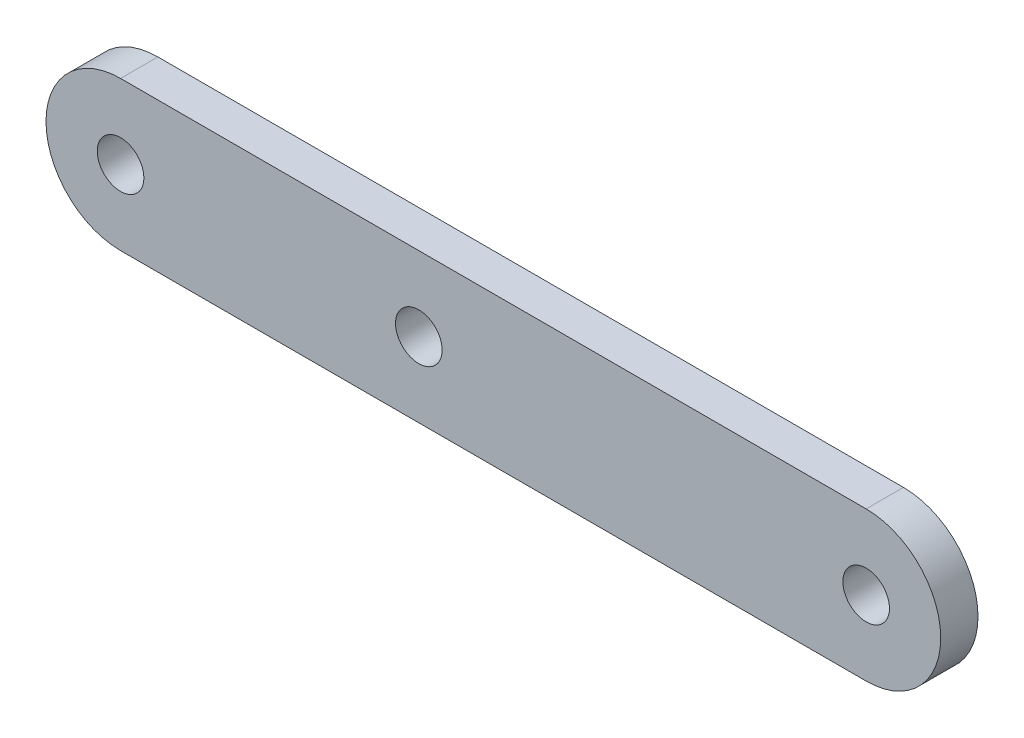
ISO-10303-21;
HEADER;
FILE_DESCRIPTION(('STEP AP214'),'2;1');
FILE_NAME('part.step','',(''),(''),'','','');
FILE_SCHEMA(('AUTOMOTIVE_DESIGN { 1 0 10303 214 1 1 1 1 }'));
ENDSEC;
DATA;
#1=APPLICATION_CONTEXT('core data for automotive mechanical design processes');
#2=APPLICATION_PROTOCOL_DEFINITION('international standard','automotive_design',2000,#1);
#3=PRODUCT_CONTEXT('',#1,'mechanical');
#4=PRODUCT('Part','Part','',(#3));
#5=PRODUCT_RELATED_PRODUCT_CATEGORY('part','',(#4));
#6=PRODUCT_DEFINITION_FORMATION('','',#4);
#7=PRODUCT_DEFINITION_CONTEXT('part definition',#1,'design');
#8=PRODUCT_DEFINITION('design','',#6,#7);
#9=PRODUCT_DEFINITION_SHAPE('','',#8);
#10=(LENGTH_UNIT() NAMED_UNIT(*) SI_UNIT(.MILLI.,.METRE.));
#11=(NAMED_UNIT(*) PLANE_ANGLE_UNIT() SI_UNIT($,.RADIAN.));
#12=(NAMED_UNIT(*) SI_UNIT($,.STERADIAN.) SOLID_ANGLE_UNIT());
#13=UNCERTAINTY_MEASURE_WITH_UNIT(LENGTH_MEASURE(1.E-05),#10,'distance_accuracy_value','');
#14=(GEOMETRIC_REPRESENTATION_CONTEXT(3) GLOBAL_UNCERTAINTY_ASSIGNED_CONTEXT((#13)) GLOBAL_UNIT_ASSIGNED_CONTEXT((#10,
#11,#12)) REPRESENTATION_CONTEXT('',''));
#15=CARTESIAN_POINT('',(0.,0.,0.));
#16=DIRECTION('',(0.,0.,1.));
#17=DIRECTION('',(1.,0.,0.));
#18=AXIS2_PLACEMENT_3D('',#15,#16,#17);
#19=CARTESIAN_POINT('',(-20.,0.,2.));
#20=DIRECTION('',(0.,0.,1.));
#21=DIRECTION('',(1.,0.,0.));
#22=AXIS2_PLACEMENT_3D('',#19,#20,#21);
#23=PLANE('',#22);
#24=CARTESIAN_POINT('',(20.,0.,2.));
#25=DIRECTION('',(0.,0.,1.));
#26=DIRECTION('',(1.,0.,0.));
#27=AXIS2_PLACEMENT_3D('',#24,#25,#26);
#28=CIRCLE('',#27,1.25);
#29=CARTESIAN_POINT('',(21.25,0.,2.));
#30=VERTEX_POINT('',#29);
#31=EDGE_CURVE('E126',#30,#30,#28,.T.);
#32=ORIENTED_EDGE('',*,*,#31,.F.);
#33=EDGE_LOOP('',(#32));
#34=FACE_BOUND('',#33,.T.);
#35=CARTESIAN_POINT('',(-20.,0.,2.));
#36=DIRECTION('',(0.,0.,1.));
#37=DIRECTION('',(1.,0.,0.));
#38=AXIS2_PLACEMENT_3D('',#35,#36,#37);
#39=CIRCLE('',#38,4.);
#40=CARTESIAN_POINT('',(-20.,4.,2.));
#41=VERTEX_POINT('',#40);
#42=CARTESIAN_POINT('',(-20.,-4.,2.));
#43=VERTEX_POINT('',#42);
#44=EDGE_CURVE('E96',#41,#43,#39,.T.);
#45=ORIENTED_EDGE('',*,*,#44,.T.);
#46=DIRECTION('',(1.,0.,0.));
#47=VECTOR('',#46,1.);
#48=CARTESIAN_POINT('',(20.,-4.,2.));
#49=LINE('',#48,#47);
#50=CARTESIAN_POINT('',(20.,-4.,2.));
#51=VERTEX_POINT('',#50);
#52=EDGE_CURVE('E91',#43,#51,#49,.T.);
#53=ORIENTED_EDGE('',*,*,#52,.T.);
#54=CARTESIAN_POINT('',(20.,0.,2.));
#55=DIRECTION('',(0.,0.,1.));
#56=DIRECTION('',(-1.,0.,0.));
#57=AXIS2_PLACEMENT_3D('',#54,#55,#56);
#58=CIRCLE('',#57,4.);
#59=CARTESIAN_POINT('',(20.,4.,2.));
#60=VERTEX_POINT('',#59);
#61=EDGE_CURVE('E94',#51,#60,#58,.T.);
#62=ORIENTED_EDGE('',*,*,#61,.T.);
#63=DIRECTION('',(-1.,0.,0.));
#64=VECTOR('',#63,1.);
#65=CARTESIAN_POINT('',(20.,4.,2.));
#66=LINE('',#65,#64);
#67=EDGE_CURVE('E61',#60,#41,#66,.T.);
#68=ORIENTED_EDGE('',*,*,#67,.T.);
#69=EDGE_LOOP('',(#45,#53,#62,#68));
#70=FACE_BOUND('',#69,.T.);
#71=CARTESIAN_POINT('',(-20.,0.,2.));
#72=DIRECTION('',(0.,0.,1.));
#73=DIRECTION('',(1.,0.,0.));
#74=AXIS2_PLACEMENT_3D('',#71,#72,#73);
#75=CIRCLE('',#74,1.25);
#76=CARTESIAN_POINT('',(-18.75,0.,2.));
#77=VERTEX_POINT('',#76);
#78=EDGE_CURVE('E111',#77,#77,#75,.T.);
#79=ORIENTED_EDGE('',*,*,#78,.F.);
#80=EDGE_LOOP('',(#79));
#81=FACE_BOUND('',#80,.T.);
#82=CARTESIAN_POINT('',(-4.,0.,2.));
#83=DIRECTION('',(0.,0.,1.));
#84=DIRECTION('',(1.,0.,0.));
#85=AXIS2_PLACEMENT_3D('',#82,#83,#84);
#86=CIRCLE('',#85,1.25);
#87=CARTESIAN_POINT('',(-2.75,0.,2.));
#88=VERTEX_POINT('',#87);
#89=EDGE_CURVE('E132',#88,#88,#86,.T.);
#90=ORIENTED_EDGE('',*,*,#89,.F.);
#91=EDGE_LOOP('',(#90));
#92=FACE_BOUND('',#91,.T.);
#93=ADVANCED_FACE('F44',(#34,#70,#81,#92),#23,.T.);
#94=CARTESIAN_POINT('',(-20.,0.,0.));
#95=DIRECTION('',(0.,0.,1.));
#96=DIRECTION('',(1.,0.,0.));
#97=AXIS2_PLACEMENT_3D('',#94,#95,#96);
#98=PLANE('',#97);
#99=CARTESIAN_POINT('',(20.,0.,0.));
#100=DIRECTION('',(0.,0.,1.));
#101=DIRECTION('',(1.,0.,0.));
#102=AXIS2_PLACEMENT_3D('',#99,#100,#101);
#103=CIRCLE('',#102,1.25);
#104=CARTESIAN_POINT('',(21.25,0.,0.));
#105=VERTEX_POINT('',#104);
#106=EDGE_CURVE('E129',#105,#105,#103,.T.);
#107=ORIENTED_EDGE('',*,*,#106,.T.);
#108=EDGE_LOOP('',(#107));
#109=FACE_BOUND('',#108,.T.);
#110=CARTESIAN_POINT('',(-20.,0.,0.));
#111=DIRECTION('',(0.,0.,1.));
#112=DIRECTION('',(1.,0.,0.));
#113=AXIS2_PLACEMENT_3D('',#110,#111,#112);
#114=CIRCLE('',#113,4.);
#115=CARTESIAN_POINT('',(-20.,4.,0.));
#116=VERTEX_POINT('',#115);
#117=CARTESIAN_POINT('',(-20.,-4.,0.));
#118=VERTEX_POINT('',#117);
#119=EDGE_CURVE('E108',#116,#118,#114,.T.);
#120=ORIENTED_EDGE('',*,*,#119,.F.);
#121=DIRECTION('',(-1.,0.,0.));
#122=VECTOR('',#121,1.);
#123=CARTESIAN_POINT('',(20.,4.,0.));
#124=LINE('',#123,#122);
#125=CARTESIAN_POINT('',(20.,4.,0.));
#126=VERTEX_POINT('',#125);
#127=EDGE_CURVE('E84',#126,#116,#124,.T.);
#128=ORIENTED_EDGE('',*,*,#127,.F.);
#129=CARTESIAN_POINT('',(20.,0.,0.));
#130=DIRECTION('',(0.,0.,1.));
#131=DIRECTION('',(-1.,0.,0.));
#132=AXIS2_PLACEMENT_3D('',#129,#130,#131);
#133=CIRCLE('',#132,4.);
#134=CARTESIAN_POINT('',(20.,-4.,0.));
#135=VERTEX_POINT('',#134);
#136=EDGE_CURVE('E78',#135,#126,#133,.T.);
#137=ORIENTED_EDGE('',*,*,#136,.F.);
#138=DIRECTION('',(1.,0.,0.));
#139=VECTOR('',#138,1.);
#140=CARTESIAN_POINT('',(20.,-4.,0.));
#141=LINE('',#140,#139);
#142=EDGE_CURVE('E100',#118,#135,#141,.T.);
#143=ORIENTED_EDGE('',*,*,#142,.F.);
#144=EDGE_LOOP('',(#120,#128,#137,#143));
#145=FACE_BOUND('',#144,.T.);
#146=CARTESIAN_POINT('',(-20.,0.,0.));
#147=DIRECTION('',(0.,0.,1.));
#148=DIRECTION('',(1.,0.,0.));
#149=AXIS2_PLACEMENT_3D('',#146,#147,#148);
#150=CIRCLE('',#149,1.25);
#151=CARTESIAN_POINT('',(-18.75,0.,0.));
#152=VERTEX_POINT('',#151);
#153=EDGE_CURVE('E123',#152,#152,#150,.T.);
#154=ORIENTED_EDGE('',*,*,#153,.T.);
#155=EDGE_LOOP('',(#154));
#156=FACE_BOUND('',#155,.T.);
#157=CARTESIAN_POINT('',(-4.,0.,0.));
#158=DIRECTION('',(0.,0.,1.));
#159=DIRECTION('',(1.,0.,0.));
#160=AXIS2_PLACEMENT_3D('',#157,#158,#159);
#161=CIRCLE('',#160,1.25);
#162=CARTESIAN_POINT('',(-2.75,0.,0.));
#163=VERTEX_POINT('',#162);
#164=EDGE_CURVE('E135',#163,#163,#161,.T.);
#165=ORIENTED_EDGE('',*,*,#164,.T.);
#166=EDGE_LOOP('',(#165));
#167=FACE_BOUND('',#166,.T.);
#168=ADVANCED_FACE('F119',(#109,#145,#156,#167),#98,.F.);
#169=CARTESIAN_POINT('',(-20.,0.,2.));
#170=DIRECTION('',(0.,0.,-1.));
#171=DIRECTION('',(-1.,0.,0.));
#172=AXIS2_PLACEMENT_3D('',#169,#170,#171);
#173=CYLINDRICAL_SURFACE('',#172,4.);
#174=ORIENTED_EDGE('',*,*,#119,.T.);
#175=DIRECTION('',(0.,0.,-1.));
#176=VECTOR('',#175,1.);
#177=CARTESIAN_POINT('',(-20.,-4.,2.));
#178=LINE('',#177,#176);
#179=EDGE_CURVE('E13',#43,#118,#178,.T.);
#180=ORIENTED_EDGE('',*,*,#179,.F.);
#181=ORIENTED_EDGE('',*,*,#44,.F.);
#182=DIRECTION('',(0.,0.,-1.));
#183=VECTOR('',#182,1.);
#184=CARTESIAN_POINT('',(-20.,4.,2.));
#185=LINE('',#184,#183);
#186=EDGE_CURVE('E104',#41,#116,#185,.T.);
#187=ORIENTED_EDGE('',*,*,#186,.T.);
#188=EDGE_LOOP('',(#174,#180,#181,#187));
#189=FACE_BOUND('',#188,.T.);
#190=ADVANCED_FACE('F46',(#189),#173,.T.);
#191=CARTESIAN_POINT('',(20.,-4.,2.));
#192=DIRECTION('',(0.,1.,0.));
#193=DIRECTION('',(-1.,0.,0.));
#194=AXIS2_PLACEMENT_3D('',#191,#192,#193);
#195=PLANE('',#194);
#196=ORIENTED_EDGE('',*,*,#142,.T.);
#197=DIRECTION('',(0.,0.,-1.));
#198=VECTOR('',#197,1.);
#199=CARTESIAN_POINT('',(20.,-4.,2.));
#200=LINE('',#199,#198);
#201=EDGE_CURVE('E53',#51,#135,#200,.T.);
#202=ORIENTED_EDGE('',*,*,#201,.F.);
#203=ORIENTED_EDGE('',*,*,#52,.F.);
#204=ORIENTED_EDGE('',*,*,#179,.T.);
#205=EDGE_LOOP('',(#196,#202,#203,#204));
#206=FACE_BOUND('',#205,.T.);
#207=ADVANCED_FACE('F99',(#206),#195,.F.);
#208=CARTESIAN_POINT('',(20.,0.,2.));
#209=DIRECTION('',(0.,0.,-1.));
#210=DIRECTION('',(-1.,0.,0.));
#211=AXIS2_PLACEMENT_3D('',#208,#209,#210);
#212=CYLINDRICAL_SURFACE('',#211,4.);
#213=ORIENTED_EDGE('',*,*,#136,.T.);
#214=DIRECTION('',(0.,0.,-1.));
#215=VECTOR('',#214,1.);
#216=CARTESIAN_POINT('',(20.,4.,2.));
#217=LINE('',#216,#215);
#218=EDGE_CURVE('E101',#60,#126,#217,.T.);
#219=ORIENTED_EDGE('',*,*,#218,.F.);
#220=ORIENTED_EDGE('',*,*,#61,.F.);
#221=ORIENTED_EDGE('',*,*,#201,.T.);
#222=EDGE_LOOP('',(#213,#219,#220,#221));
#223=FACE_BOUND('',#222,.T.);
#224=ADVANCED_FACE('F102',(#223),#212,.T.);
#225=CARTESIAN_POINT('',(20.,4.,2.));
#226=DIRECTION('',(0.,-1.,0.));
#227=DIRECTION('',(1.,0.,0.));
#228=AXIS2_PLACEMENT_3D('',#225,#226,#227);
#229=PLANE('',#228);
#230=ORIENTED_EDGE('',*,*,#127,.T.);
#231=ORIENTED_EDGE('',*,*,#186,.F.);
#232=ORIENTED_EDGE('',*,*,#67,.F.);
#233=ORIENTED_EDGE('',*,*,#218,.T.);
#234=EDGE_LOOP('',(#230,#231,#232,#233));
#235=FACE_BOUND('',#234,.T.);
#236=ADVANCED_FACE('F116',(#235),#229,.F.);
#237=CARTESIAN_POINT('',(-20.,0.,2.));
#238=DIRECTION('',(0.,0.,-1.));
#239=DIRECTION('',(-1.,0.,0.));
#240=AXIS2_PLACEMENT_3D('',#237,#238,#239);
#241=CYLINDRICAL_SURFACE('',#240,1.25);
#242=ORIENTED_EDGE('',*,*,#78,.T.);
#243=EDGE_LOOP('',(#242));
#244=FACE_BOUND('',#243,.T.);
#245=ORIENTED_EDGE('',*,*,#153,.F.);
#246=EDGE_LOOP('',(#245));
#247=FACE_BOUND('',#246,.T.);
#248=ADVANCED_FACE('F154',(#244,#247),#241,.F.);
#249=CARTESIAN_POINT('',(20.,0.,2.));
#250=DIRECTION('',(0.,0.,-1.));
#251=DIRECTION('',(-1.,0.,0.));
#252=AXIS2_PLACEMENT_3D('',#249,#250,#251);
#253=CYLINDRICAL_SURFACE('',#252,1.25);
#254=ORIENTED_EDGE('',*,*,#31,.T.);
#255=EDGE_LOOP('',(#254));
#256=FACE_BOUND('',#255,.T.);
#257=ORIENTED_EDGE('',*,*,#106,.F.);
#258=EDGE_LOOP('',(#257));
#259=FACE_BOUND('',#258,.T.);
#260=ADVANCED_FACE('F200',(#256,#259),#253,.F.);
#261=CARTESIAN_POINT('',(-4.,0.,2.));
#262=DIRECTION('',(0.,0.,-1.));
#263=DIRECTION('',(-1.,0.,0.));
#264=AXIS2_PLACEMENT_3D('',#261,#262,#263);
#265=CYLINDRICAL_SURFACE('',#264,1.25);
#266=ORIENTED_EDGE('',*,*,#89,.T.);
#267=EDGE_LOOP('',(#266));
#268=FACE_BOUND('',#267,.T.);
#269=ORIENTED_EDGE('',*,*,#164,.F.);
#270=EDGE_LOOP('',(#269));
#271=FACE_BOUND('',#270,.T.);
#272=ADVANCED_FACE('F141',(#268,#271),#265,.F.);
#273=CLOSED_SHELL('',(#93,#168,#190,#207,#224,#236,#248,#260,#272));
#274=MANIFOLD_SOLID_BREP('B2',#273);
#275=ADVANCED_BREP_SHAPE_REPRESENTATION('',(#18,#274),#14);
#276=SHAPE_DEFINITION_REPRESENTATION(#9,#275);
ENDSEC;
END-ISO-10303-21;
